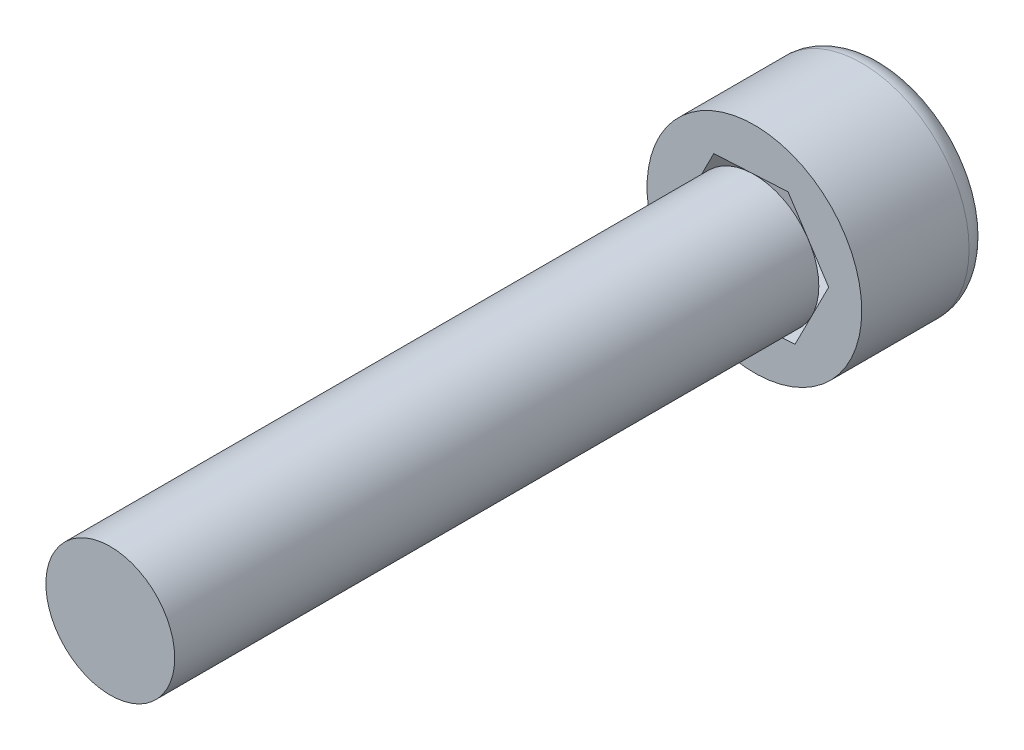
ISO-10303-21;
HEADER;
FILE_DESCRIPTION(('STEP AP214'),'2;1');
FILE_NAME('part.step','',(''),(''),'','','');
FILE_SCHEMA(('AUTOMOTIVE_DESIGN { 1 0 10303 214 1 1 1 1 }'));
ENDSEC;
DATA;
#1=APPLICATION_CONTEXT('core data for automotive mechanical design processes');
#2=APPLICATION_PROTOCOL_DEFINITION('international standard','automotive_design',2000,#1);
#3=PRODUCT_CONTEXT('',#1,'mechanical');
#4=PRODUCT('Part','Part','',(#3));
#5=PRODUCT_RELATED_PRODUCT_CATEGORY('part','',(#4));
#6=PRODUCT_DEFINITION_FORMATION('','',#4);
#7=PRODUCT_DEFINITION_CONTEXT('part definition',#1,'design');
#8=PRODUCT_DEFINITION('design','',#6,#7);
#9=PRODUCT_DEFINITION_SHAPE('','',#8);
#10=(LENGTH_UNIT() NAMED_UNIT(*) SI_UNIT(.MILLI.,.METRE.));
#11=(NAMED_UNIT(*) PLANE_ANGLE_UNIT() SI_UNIT($,.RADIAN.));
#12=(NAMED_UNIT(*) SI_UNIT($,.STERADIAN.) SOLID_ANGLE_UNIT());
#13=UNCERTAINTY_MEASURE_WITH_UNIT(LENGTH_MEASURE(1.E-05),#10,'distance_accuracy_value','');
#14=(GEOMETRIC_REPRESENTATION_CONTEXT(3) GLOBAL_UNCERTAINTY_ASSIGNED_CONTEXT((#13)) GLOBAL_UNIT_ASSIGNED_CONTEXT((#10,
#11,#12)) REPRESENTATION_CONTEXT('',''));
#15=CARTESIAN_POINT('',(0.,0.,0.));
#16=DIRECTION('',(0.,0.,1.));
#17=DIRECTION('',(1.,0.,0.));
#18=AXIS2_PLACEMENT_3D('',#15,#16,#17);
#19=CARTESIAN_POINT('',(0.,0.,3.));
#20=DIRECTION('',(0.,0.,-1.));
#21=DIRECTION('',(-1.,0.,0.));
#22=AXIS2_PLACEMENT_3D('',#19,#20,#21);
#23=CYLINDRICAL_SURFACE('',#22,2.5);
#24=CARTESIAN_POINT('',(0.,0.,0.5));
#25=DIRECTION('',(0.,0.,1.));
#26=DIRECTION('',(1.,0.,0.));
#27=AXIS2_PLACEMENT_3D('',#24,#25,#26);
#28=CIRCLE('',#27,2.5);
#29=CARTESIAN_POINT('',(2.5,0.,0.5));
#30=VERTEX_POINT('',#29);
#31=EDGE_CURVE('E50',#30,#30,#28,.T.);
#32=ORIENTED_EDGE('',*,*,#31,.T.);
#33=EDGE_LOOP('',(#32));
#34=FACE_BOUND('',#33,.T.);
#35=CARTESIAN_POINT('',(0.,0.,3.));
#36=DIRECTION('',(0.,0.,1.));
#37=DIRECTION('',(1.,0.,0.));
#38=AXIS2_PLACEMENT_3D('',#35,#36,#37);
#39=CIRCLE('',#38,2.5);
#40=CARTESIAN_POINT('',(2.5,0.,3.));
#41=VERTEX_POINT('',#40);
#42=EDGE_CURVE('E165',#41,#41,#39,.T.);
#43=ORIENTED_EDGE('',*,*,#42,.F.);
#44=EDGE_LOOP('',(#43));
#45=FACE_BOUND('',#44,.T.);
#46=ADVANCED_FACE('F41',(#34,#45),#23,.T.);
#47=CARTESIAN_POINT('',(0.,0.,3.));
#48=DIRECTION('',(0.,0.,1.));
#49=DIRECTION('',(1.,0.,0.));
#50=AXIS2_PLACEMENT_3D('',#47,#48,#49);
#51=PLANE('',#50);
#52=DIRECTION('',(-0.998565318577122,-0.0535472178079434,0.));
#53=VECTOR('',#52,1.);
#54=CARTESIAN_POINT('',(0.945103759937804,-1.45147472694203,3.));
#55=LINE('',#54,#53);
#56=CARTESIAN_POINT('',(0.945103759937804,-1.45147472694203,3.));
#57=VERTEX_POINT('',#56);
#58=CARTESIAN_POINT('',(-0.784462106513973,-1.54422122878934,3.));
#59=VERTEX_POINT('',#58);
#60=EDGE_CURVE('E94',#57,#59,#55,.T.);
#61=ORIENTED_EDGE('',*,*,#60,.T.);
#62=DIRECTION('',(-0.545655910212218,0.838009324321917,0.));
#63=VECTOR('',#62,1.);
#64=CARTESIAN_POINT('',(-0.784462106513973,-1.54422122878934,3.));
#65=LINE('',#64,#63);
#66=CARTESIAN_POINT('',(-1.72956586645178,-0.0927465018473138,3.));
#67=VERTEX_POINT('',#66);
#68=EDGE_CURVE('E57',#59,#67,#65,.T.);
#69=ORIENTED_EDGE('',*,*,#68,.T.);
#70=DIRECTION('',(0.452909408364904,0.89155654212986,0.));
#71=VECTOR('',#70,1.);
#72=CARTESIAN_POINT('',(-1.72956586645178,-0.0927465018473138,3.));
#73=LINE('',#72,#71);
#74=CARTESIAN_POINT('',(-0.945103759937803,1.45147472694203,3.));
#75=VERTEX_POINT('',#74);
#76=EDGE_CURVE('E104',#67,#75,#73,.T.);
#77=ORIENTED_EDGE('',*,*,#76,.T.);
#78=DIRECTION('',(0.998565318577122,0.0535472178079431,0.));
#79=VECTOR('',#78,1.);
#80=CARTESIAN_POINT('',(-0.945103759937803,1.45147472694203,3.));
#81=LINE('',#80,#79);
#82=CARTESIAN_POINT('',(0.784462106513974,1.54422122878934,3.));
#83=VERTEX_POINT('',#82);
#84=EDGE_CURVE('E176',#75,#83,#81,.T.);
#85=ORIENTED_EDGE('',*,*,#84,.T.);
#86=DIRECTION('',(0.545655910212218,-0.838009324321917,0.));
#87=VECTOR('',#86,1.);
#88=CARTESIAN_POINT('',(0.784462106513974,1.54422122878934,3.));
#89=LINE('',#88,#87);
#90=CARTESIAN_POINT('',(1.72956586645178,0.0927465018473145,3.));
#91=VERTEX_POINT('',#90);
#92=EDGE_CURVE('E174',#83,#91,#89,.T.);
#93=ORIENTED_EDGE('',*,*,#92,.T.);
#94=DIRECTION('',(-0.452909408364904,-0.89155654212986,0.));
#95=VECTOR('',#94,1.);
#96=CARTESIAN_POINT('',(1.72956586645178,0.0927465018473145,3.));
#97=LINE('',#96,#95);
#98=EDGE_CURVE('E109',#91,#57,#97,.T.);
#99=ORIENTED_EDGE('',*,*,#98,.T.);
#100=EDGE_LOOP('',(#61,#69,#77,#85,#93,#99));
#101=FACE_BOUND('',#100,.T.);
#102=ORIENTED_EDGE('',*,*,#42,.T.);
#103=EDGE_LOOP('',(#102));
#104=FACE_BOUND('',#103,.T.);
#105=ADVANCED_FACE('F106',(#101,#104),#51,.T.);
#106=CARTESIAN_POINT('',(0.,0.,0.));
#107=DIRECTION('',(0.,0.,1.));
#108=DIRECTION('',(1.,0.,0.));
#109=AXIS2_PLACEMENT_3D('',#106,#107,#108);
#110=PLANE('',#109);
#111=CARTESIAN_POINT('',(0.,0.,0.));
#112=DIRECTION('',(0.,0.,1.));
#113=DIRECTION('',(1.,0.,0.));
#114=AXIS2_PLACEMENT_3D('',#111,#112,#113);
#115=CIRCLE('',#114,2.);
#116=CARTESIAN_POINT('',(2.,0.,0.));
#117=VERTEX_POINT('',#116);
#118=EDGE_CURVE('E12',#117,#117,#115,.F.);
#119=ORIENTED_EDGE('',*,*,#118,.T.);
#120=EDGE_LOOP('',(#119));
#121=FACE_BOUND('',#120,.T.);
#122=DIRECTION('',(-0.545655910212218,0.838009324321917,0.));
#123=VECTOR('',#122,1.);
#124=CARTESIAN_POINT('',(-0.784462106513973,-1.54422122878934,0.));
#125=LINE('',#124,#123);
#126=CARTESIAN_POINT('',(-0.784462106513973,-1.54422122878934,0.));
#127=VERTEX_POINT('',#126);
#128=CARTESIAN_POINT('',(-1.72956586645178,-0.0927465018473138,0.));
#129=VERTEX_POINT('',#128);
#130=EDGE_CURVE('E99',#127,#129,#125,.T.);
#131=ORIENTED_EDGE('',*,*,#130,.F.);
#132=DIRECTION('',(-0.998565318577122,-0.0535472178079434,0.));
#133=VECTOR('',#132,1.);
#134=CARTESIAN_POINT('',(0.945103759937804,-1.45147472694203,0.));
#135=LINE('',#134,#133);
#136=CARTESIAN_POINT('',(0.945103759937804,-1.45147472694203,0.));
#137=VERTEX_POINT('',#136);
#138=EDGE_CURVE('E90',#137,#127,#135,.T.);
#139=ORIENTED_EDGE('',*,*,#138,.F.);
#140=DIRECTION('',(-0.452909408364904,-0.89155654212986,0.));
#141=VECTOR('',#140,1.);
#142=CARTESIAN_POINT('',(1.72956586645178,0.0927465018473145,0.));
#143=LINE('',#142,#141);
#144=CARTESIAN_POINT('',(1.72956586645178,0.0927465018473145,0.));
#145=VERTEX_POINT('',#144);
#146=EDGE_CURVE('E156',#145,#137,#143,.T.);
#147=ORIENTED_EDGE('',*,*,#146,.F.);
#148=DIRECTION('',(0.545655910212218,-0.838009324321917,0.));
#149=VECTOR('',#148,1.);
#150=CARTESIAN_POINT('',(0.784462106513974,1.54422122878934,0.));
#151=LINE('',#150,#149);
#152=CARTESIAN_POINT('',(0.784462106513974,1.54422122878934,0.));
#153=VERTEX_POINT('',#152);
#154=EDGE_CURVE('E189',#153,#145,#151,.T.);
#155=ORIENTED_EDGE('',*,*,#154,.F.);
#156=DIRECTION('',(0.998565318577122,0.0535472178079431,0.));
#157=VECTOR('',#156,1.);
#158=CARTESIAN_POINT('',(-0.945103759937803,1.45147472694203,0.));
#159=LINE('',#158,#157);
#160=CARTESIAN_POINT('',(-0.945103759937803,1.45147472694203,0.));
#161=VERTEX_POINT('',#160);
#162=EDGE_CURVE('E185',#161,#153,#159,.T.);
#163=ORIENTED_EDGE('',*,*,#162,.F.);
#164=DIRECTION('',(0.452909408364904,0.89155654212986,0.));
#165=VECTOR('',#164,1.);
#166=CARTESIAN_POINT('',(-1.72956586645178,-0.0927465018473138,0.));
#167=LINE('',#166,#165);
#168=EDGE_CURVE('E182',#129,#161,#167,.T.);
#169=ORIENTED_EDGE('',*,*,#168,.F.);
#170=EDGE_LOOP('',(#131,#139,#147,#155,#163,#169));
#171=FACE_BOUND('',#170,.T.);
#172=ADVANCED_FACE('F131',(#121,#171),#110,.F.);
#173=CARTESIAN_POINT('',(0.945103759937804,-1.45147472694203,3.));
#174=DIRECTION('',(0.0535472178079434,-0.998565318577122,0.));
#175=DIRECTION('',(0.998565318577122,0.0535472178079434,0.));
#176=AXIS2_PLACEMENT_3D('',#173,#174,#175);
#177=PLANE('',#176);
#178=ORIENTED_EDGE('',*,*,#138,.T.);
#179=DIRECTION('',(0.,0.,-1.));
#180=VECTOR('',#179,1.);
#181=CARTESIAN_POINT('',(-0.784462106513973,-1.54422122878934,3.));
#182=LINE('',#181,#180);
#183=EDGE_CURVE('E92',#59,#127,#182,.T.);
#184=ORIENTED_EDGE('',*,*,#183,.F.);
#185=ORIENTED_EDGE('',*,*,#60,.F.);
#186=DIRECTION('',(0.,0.,-1.));
#187=VECTOR('',#186,1.);
#188=CARTESIAN_POINT('',(0.945103759937804,-1.45147472694203,3.));
#189=LINE('',#188,#187);
#190=EDGE_CURVE('E157',#57,#137,#189,.T.);
#191=ORIENTED_EDGE('',*,*,#190,.T.);
#192=EDGE_LOOP('',(#178,#184,#185,#191));
#193=FACE_BOUND('',#192,.T.);
#194=ADVANCED_FACE('F93',(#193),#177,.F.);
#195=CARTESIAN_POINT('',(1.72956586645178,0.0927465018473145,3.));
#196=DIRECTION('',(0.89155654212986,-0.452909408364904,0.));
#197=DIRECTION('',(0.452909408364904,0.89155654212986,0.));
#198=AXIS2_PLACEMENT_3D('',#195,#196,#197);
#199=PLANE('',#198);
#200=ORIENTED_EDGE('',*,*,#146,.T.);
#201=ORIENTED_EDGE('',*,*,#190,.F.);
#202=ORIENTED_EDGE('',*,*,#98,.F.);
#203=DIRECTION('',(0.,0.,-1.));
#204=VECTOR('',#203,1.);
#205=CARTESIAN_POINT('',(1.72956586645178,0.0927465018473145,3.));
#206=LINE('',#205,#204);
#207=EDGE_CURVE('E159',#91,#145,#206,.T.);
#208=ORIENTED_EDGE('',*,*,#207,.T.);
#209=EDGE_LOOP('',(#200,#201,#202,#208));
#210=FACE_BOUND('',#209,.T.);
#211=ADVANCED_FACE('F138',(#210),#199,.F.);
#212=CARTESIAN_POINT('',(0.784462106513974,1.54422122878934,3.));
#213=DIRECTION('',(0.838009324321917,0.545655910212218,0.));
#214=DIRECTION('',(-0.545655910212218,0.838009324321917,0.));
#215=AXIS2_PLACEMENT_3D('',#212,#213,#214);
#216=PLANE('',#215);
#217=ORIENTED_EDGE('',*,*,#154,.T.);
#218=ORIENTED_EDGE('',*,*,#207,.F.);
#219=ORIENTED_EDGE('',*,*,#92,.F.);
#220=DIRECTION('',(0.,0.,-1.));
#221=VECTOR('',#220,1.);
#222=CARTESIAN_POINT('',(0.784462106513974,1.54422122878934,3.));
#223=LINE('',#222,#221);
#224=EDGE_CURVE('E187',#83,#153,#223,.T.);
#225=ORIENTED_EDGE('',*,*,#224,.T.);
#226=EDGE_LOOP('',(#217,#218,#219,#225));
#227=FACE_BOUND('',#226,.T.);
#228=ADVANCED_FACE('F146',(#227),#216,.F.);
#229=CARTESIAN_POINT('',(-0.945103759937803,1.45147472694203,3.));
#230=DIRECTION('',(-0.0535472178079431,0.998565318577122,0.));
#231=DIRECTION('',(-0.998565318577122,-0.0535472178079432,0.));
#232=AXIS2_PLACEMENT_3D('',#229,#230,#231);
#233=PLANE('',#232);
#234=ORIENTED_EDGE('',*,*,#162,.T.);
#235=ORIENTED_EDGE('',*,*,#224,.F.);
#236=ORIENTED_EDGE('',*,*,#84,.F.);
#237=DIRECTION('',(0.,0.,-1.));
#238=VECTOR('',#237,1.);
#239=CARTESIAN_POINT('',(-0.945103759937803,1.45147472694203,3.));
#240=LINE('',#239,#238);
#241=EDGE_CURVE('E181',#75,#161,#240,.T.);
#242=ORIENTED_EDGE('',*,*,#241,.T.);
#243=EDGE_LOOP('',(#234,#235,#236,#242));
#244=FACE_BOUND('',#243,.T.);
#245=ADVANCED_FACE('F142',(#244),#233,.F.);
#246=CARTESIAN_POINT('',(-1.72956586645178,-0.0927465018473138,3.));
#247=DIRECTION('',(-0.89155654212986,0.452909408364904,0.));
#248=DIRECTION('',(-0.452909408364904,-0.89155654212986,0.));
#249=AXIS2_PLACEMENT_3D('',#246,#247,#248);
#250=PLANE('',#249);
#251=ORIENTED_EDGE('',*,*,#168,.T.);
#252=ORIENTED_EDGE('',*,*,#241,.F.);
#253=ORIENTED_EDGE('',*,*,#76,.F.);
#254=DIRECTION('',(0.,0.,-1.));
#255=VECTOR('',#254,1.);
#256=CARTESIAN_POINT('',(-1.72956586645178,-0.0927465018473138,3.));
#257=LINE('',#256,#255);
#258=EDGE_CURVE('E102',#67,#129,#257,.T.);
#259=ORIENTED_EDGE('',*,*,#258,.T.);
#260=EDGE_LOOP('',(#251,#252,#253,#259));
#261=FACE_BOUND('',#260,.T.);
#262=ADVANCED_FACE('F123',(#261),#250,.F.);
#263=CARTESIAN_POINT('',(-0.784462106513973,-1.54422122878934,3.));
#264=DIRECTION('',(-0.838009324321917,-0.545655910212218,0.));
#265=DIRECTION('',(0.545655910212218,-0.838009324321917,0.));
#266=AXIS2_PLACEMENT_3D('',#263,#264,#265);
#267=PLANE('',#266);
#268=ORIENTED_EDGE('',*,*,#130,.T.);
#269=ORIENTED_EDGE('',*,*,#258,.F.);
#270=ORIENTED_EDGE('',*,*,#68,.F.);
#271=ORIENTED_EDGE('',*,*,#183,.T.);
#272=EDGE_LOOP('',(#268,#269,#270,#271));
#273=FACE_BOUND('',#272,.T.);
#274=ADVANCED_FACE('F101',(#273),#267,.F.);
#275=CARTESIAN_POINT('',(0.,0.,0.5));
#276=DIRECTION('',(0.,0.,1.));
#277=DIRECTION('',(1.,0.,0.));
#278=AXIS2_PLACEMENT_3D('',#275,#276,#277);
#279=TOROIDAL_SURFACE('',#278,2.,0.5);
#280=ORIENTED_EDGE('',*,*,#118,.F.);
#281=EDGE_LOOP('',(#280));
#282=FACE_BOUND('',#281,.T.);
#283=ORIENTED_EDGE('',*,*,#31,.F.);
#284=EDGE_LOOP('',(#283));
#285=FACE_BOUND('',#284,.T.);
#286=ADVANCED_FACE('F43',(#282,#285),#279,.T.);
#287=CLOSED_SHELL('',(#46,#105,#172,#194,#211,#228,#245,#262,#274,#286));
#288=MANIFOLD_SOLID_BREP('B2',#287);
#289=CARTESIAN_POINT('',(0.,0.,18.));
#290=DIRECTION('',(0.,0.,1.));
#291=DIRECTION('',(1.,0.,0.));
#292=AXIS2_PLACEMENT_3D('',#289,#290,#291);
#293=PLANE('',#292);
#294=CARTESIAN_POINT('',(0.,0.,18.));
#295=DIRECTION('',(0.,0.,1.));
#296=DIRECTION('',(1.,0.,0.));
#297=AXIS2_PLACEMENT_3D('',#294,#295,#296);
#298=CIRCLE('',#297,1.5);
#299=CARTESIAN_POINT('',(1.5,0.,18.));
#300=VERTEX_POINT('',#299);
#301=EDGE_CURVE('E260',#300,#300,#298,.T.);
#302=ORIENTED_EDGE('',*,*,#301,.T.);
#303=EDGE_LOOP('',(#302));
#304=FACE_BOUND('',#303,.T.);
#305=ADVANCED_FACE('F253',(#304),#293,.T.);
#306=CARTESIAN_POINT('',(0.,0.,18.));
#307=DIRECTION('',(0.,0.,-1.));
#308=DIRECTION('',(-1.,0.,0.));
#309=AXIS2_PLACEMENT_3D('',#306,#307,#308);
#310=CYLINDRICAL_SURFACE('',#309,1.5);
#311=ORIENTED_EDGE('',*,*,#301,.F.);
#312=EDGE_LOOP('',(#311));
#313=FACE_BOUND('',#312,.T.);
#314=CARTESIAN_POINT('',(0.,0.,3.));
#315=DIRECTION('',(0.,0.,1.));
#316=DIRECTION('',(1.,0.,0.));
#317=AXIS2_PLACEMENT_3D('',#314,#315,#316);
#318=CIRCLE('',#317,1.5);
#319=CARTESIAN_POINT('',(1.5,0.,3.));
#320=VERTEX_POINT('',#319);
#321=EDGE_CURVE('E40',#320,#320,#318,.T.);
#322=ORIENTED_EDGE('',*,*,#321,.T.);
#323=EDGE_LOOP('',(#322));
#324=FACE_BOUND('',#323,.T.);
#325=ADVANCED_FACE('F255',(#313,#324),#310,.T.);
#326=CARTESIAN_POINT('',(0.,0.,3.));
#327=DIRECTION('',(0.,0.,-1.));
#328=DIRECTION('',(-1.,0.,0.));
#329=AXIS2_PLACEMENT_3D('',#326,#327,#328);
#330=PLANE('',#329);
#331=ORIENTED_EDGE('',*,*,#321,.F.);
#332=EDGE_LOOP('',(#331));
#333=FACE_BOUND('',#332,.T.);
#334=ADVANCED_FACE('F268',(#333),#330,.T.);
#335=CLOSED_SHELL('',(#305,#325,#334));
#336=MANIFOLD_SOLID_BREP('B6',#335);
#337=ADVANCED_BREP_SHAPE_REPRESENTATION('',(#18,#288,#336),#14);
#338=SHAPE_DEFINITION_REPRESENTATION(#9,#337);
ENDSEC;
END-ISO-10303-21;
